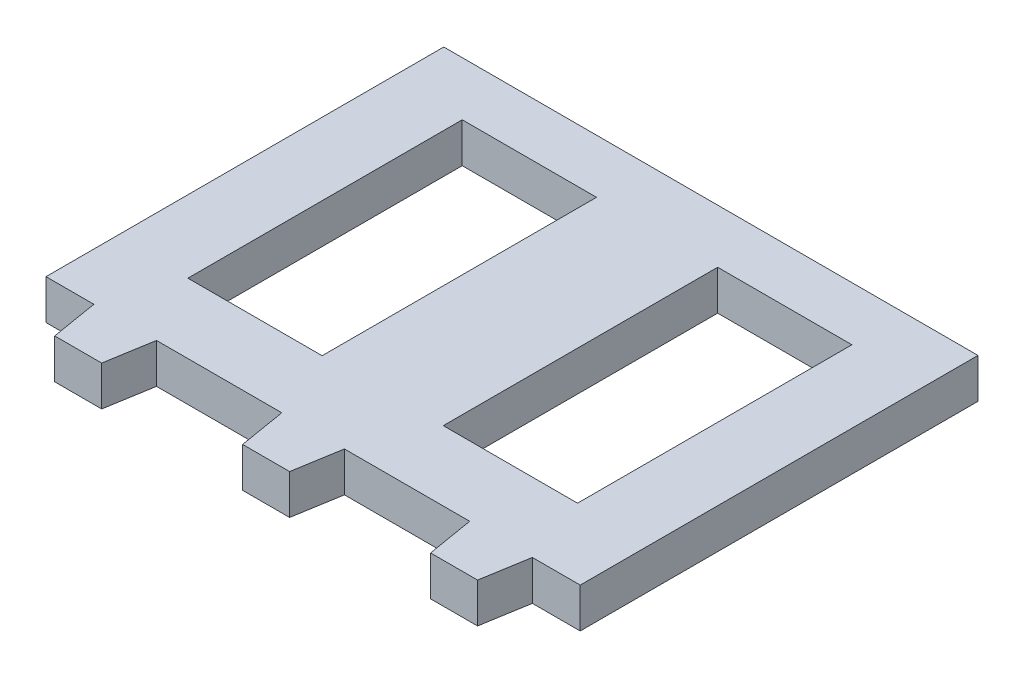
ISO-10303-21;
HEADER;
FILE_DESCRIPTION(('STEP AP214'),'2;1');
FILE_NAME('part.step','',(''),(''),'','','');
FILE_SCHEMA(('AUTOMOTIVE_DESIGN { 1 0 10303 214 1 1 1 1 }'));
ENDSEC;
DATA;
#1=APPLICATION_CONTEXT('core data for automotive mechanical design processes');
#2=APPLICATION_PROTOCOL_DEFINITION('international standard','automotive_design',2000,#1);
#3=PRODUCT_CONTEXT('',#1,'mechanical');
#4=PRODUCT('Part','Part','',(#3));
#5=PRODUCT_RELATED_PRODUCT_CATEGORY('part','',(#4));
#6=PRODUCT_DEFINITION_FORMATION('','',#4);
#7=PRODUCT_DEFINITION_CONTEXT('part definition',#1,'design');
#8=PRODUCT_DEFINITION('design','',#6,#7);
#9=PRODUCT_DEFINITION_SHAPE('','',#8);
#10=(LENGTH_UNIT() NAMED_UNIT(*) SI_UNIT(.MILLI.,.METRE.));
#11=(NAMED_UNIT(*) PLANE_ANGLE_UNIT() SI_UNIT($,.RADIAN.));
#12=(NAMED_UNIT(*) SI_UNIT($,.STERADIAN.) SOLID_ANGLE_UNIT());
#13=UNCERTAINTY_MEASURE_WITH_UNIT(LENGTH_MEASURE(1.E-05),#10,'distance_accuracy_value','');
#14=(GEOMETRIC_REPRESENTATION_CONTEXT(3) GLOBAL_UNCERTAINTY_ASSIGNED_CONTEXT((#13)) GLOBAL_UNIT_ASSIGNED_CONTEXT((#10,
#11,#12)) REPRESENTATION_CONTEXT('',''));
#15=CARTESIAN_POINT('',(0.,0.,0.));
#16=DIRECTION('',(0.,0.,1.));
#17=DIRECTION('',(1.,0.,0.));
#18=AXIS2_PLACEMENT_3D('',#15,#16,#17);
#19=CARTESIAN_POINT('',(0.,6.35,-23.158929520171));
#20=DIRECTION('',(0.,0.,1.));
#21=DIRECTION('',(1.,0.,0.));
#22=AXIS2_PLACEMENT_3D('',#19,#20,#21);
#23=PLANE('',#22);
#24=DIRECTION('',(-1.,0.,0.));
#25=VECTOR('',#24,1.);
#26=CARTESIAN_POINT('',(0.,0.,-23.158929520171));
#27=LINE('',#26,#25);
#28=CARTESIAN_POINT('',(31.1021106645058,0.,-23.158929520171));
#29=VERTEX_POINT('',#28);
#30=CARTESIAN_POINT('',(9.66965923601748,0.,-23.158929520171));
#31=VERTEX_POINT('',#30);
#32=EDGE_CURVE('E335',#29,#31,#27,.T.);
#33=ORIENTED_EDGE('',*,*,#32,.F.);
#34=DIRECTION('',(0.,-1.,0.));
#35=VECTOR('',#34,1.);
#36=CARTESIAN_POINT('',(31.1021106645058,6.35,-23.158929520171));
#37=LINE('',#36,#35);
#38=CARTESIAN_POINT('',(31.1021106645058,6.35,-23.158929520171));
#39=VERTEX_POINT('',#38);
#40=EDGE_CURVE('E11',#39,#29,#37,.T.);
#41=ORIENTED_EDGE('',*,*,#40,.F.);
#42=DIRECTION('',(-1.,0.,0.));
#43=VECTOR('',#42,1.);
#44=CARTESIAN_POINT('',(0.,6.35,-23.158929520171));
#45=LINE('',#44,#43);
#46=CARTESIAN_POINT('',(9.66965923601748,6.35,-23.158929520171));
#47=VERTEX_POINT('',#46);
#48=EDGE_CURVE('E215',#39,#47,#45,.T.);
#49=ORIENTED_EDGE('',*,*,#48,.T.);
#50=DIRECTION('',(0.,-1.,0.));
#51=VECTOR('',#50,1.);
#52=CARTESIAN_POINT('',(9.66965923601748,6.35,-23.158929520171));
#53=LINE('',#52,#51);
#54=EDGE_CURVE('E53',#47,#31,#53,.T.);
#55=ORIENTED_EDGE('',*,*,#54,.T.);
#56=EDGE_LOOP('',(#33,#41,#49,#55));
#57=FACE_BOUND('',#56,.T.);
#58=ADVANCED_FACE('F34',(#57),#23,.T.);
#59=CARTESIAN_POINT('',(31.1021106645058,6.35,0.));
#60=DIRECTION('',(1.,0.,0.));
#61=DIRECTION('',(0.,0.,-1.));
#62=AXIS2_PLACEMENT_3D('',#59,#60,#61);
#63=PLANE('',#62);
#64=DIRECTION('',(0.,0.,1.));
#65=VECTOR('',#64,1.);
#66=CARTESIAN_POINT('',(31.1021106645058,0.,0.));
#67=LINE('',#66,#65);
#68=CARTESIAN_POINT('',(31.1021106645058,0.,20.6396006199157));
#69=VERTEX_POINT('',#68);
#70=EDGE_CURVE('E220',#29,#69,#67,.T.);
#71=ORIENTED_EDGE('',*,*,#70,.T.);
#72=DIRECTION('',(0.,-1.,0.));
#73=VECTOR('',#72,1.);
#74=CARTESIAN_POINT('',(31.1021106645058,6.35,20.6396006199157));
#75=LINE('',#74,#73);
#76=CARTESIAN_POINT('',(31.1021106645058,6.35,20.6396006199157));
#77=VERTEX_POINT('',#76);
#78=EDGE_CURVE('E44',#77,#69,#75,.T.);
#79=ORIENTED_EDGE('',*,*,#78,.F.);
#80=DIRECTION('',(0.,0.,1.));
#81=VECTOR('',#80,1.);
#82=CARTESIAN_POINT('',(31.1021106645058,6.35,0.));
#83=LINE('',#82,#81);
#84=EDGE_CURVE('E210',#39,#77,#83,.T.);
#85=ORIENTED_EDGE('',*,*,#84,.F.);
#86=ORIENTED_EDGE('',*,*,#40,.T.);
#87=EDGE_LOOP('',(#71,#79,#85,#86));
#88=FACE_BOUND('',#87,.T.);
#89=ADVANCED_FACE('F218',(#88),#63,.F.);
#90=CARTESIAN_POINT('',(0.,6.35,20.6396006199157));
#91=DIRECTION('',(0.,0.,1.));
#92=DIRECTION('',(1.,0.,0.));
#93=AXIS2_PLACEMENT_3D('',#90,#91,#92);
#94=PLANE('',#93);
#95=DIRECTION('',(-1.,0.,0.));
#96=VECTOR('',#95,1.);
#97=CARTESIAN_POINT('',(0.,0.,20.6396006199157));
#98=LINE('',#97,#96);
#99=CARTESIAN_POINT('',(9.66965923601748,0.,20.6396006199157));
#100=VERTEX_POINT('',#99);
#101=EDGE_CURVE('E338',#69,#100,#98,.T.);
#102=ORIENTED_EDGE('',*,*,#101,.T.);
#103=DIRECTION('',(0.,-1.,0.));
#104=VECTOR('',#103,1.);
#105=CARTESIAN_POINT('',(9.66965923601748,6.35,20.6396006199157));
#106=LINE('',#105,#104);
#107=CARTESIAN_POINT('',(9.66965923601748,6.35,20.6396006199157));
#108=VERTEX_POINT('',#107);
#109=EDGE_CURVE('E127',#108,#100,#106,.T.);
#110=ORIENTED_EDGE('',*,*,#109,.F.);
#111=DIRECTION('',(-1.,0.,0.));
#112=VECTOR('',#111,1.);
#113=CARTESIAN_POINT('',(0.,6.35,20.6396006199157));
#114=LINE('',#113,#112);
#115=EDGE_CURVE('E202',#77,#108,#114,.T.);
#116=ORIENTED_EDGE('',*,*,#115,.F.);
#117=ORIENTED_EDGE('',*,*,#78,.T.);
#118=EDGE_LOOP('',(#102,#110,#116,#117));
#119=FACE_BOUND('',#118,.T.);
#120=ADVANCED_FACE('F204',(#119),#94,.F.);
#121=CARTESIAN_POINT('',(0.,6.35,-23.158929520171));
#122=DIRECTION('',(0.,0.,-1.));
#123=DIRECTION('',(-1.,0.,0.));
#124=AXIS2_PLACEMENT_3D('',#121,#122,#123);
#125=PLANE('',#124);
#126=DIRECTION('',(1.,0.,0.));
#127=VECTOR('',#126,1.);
#128=CARTESIAN_POINT('',(0.,0.,-23.158929520171));
#129=LINE('',#128,#127);
#130=CARTESIAN_POINT('',(-31.1021106645058,0.,-23.158929520171));
#131=VERTEX_POINT('',#130);
#132=CARTESIAN_POINT('',(-9.66965923601748,0.,-23.158929520171));
#133=VERTEX_POINT('',#132);
#134=EDGE_CURVE('E323',#131,#133,#129,.T.);
#135=ORIENTED_EDGE('',*,*,#134,.T.);
#136=DIRECTION('',(0.,-1.,0.));
#137=VECTOR('',#136,1.);
#138=CARTESIAN_POINT('',(-9.66965923601748,6.35,-23.158929520171));
#139=LINE('',#138,#137);
#140=CARTESIAN_POINT('',(-9.66965923601748,6.35,-23.158929520171));
#141=VERTEX_POINT('',#140);
#142=EDGE_CURVE('E231',#141,#133,#139,.T.);
#143=ORIENTED_EDGE('',*,*,#142,.F.);
#144=DIRECTION('',(1.,0.,0.));
#145=VECTOR('',#144,1.);
#146=CARTESIAN_POINT('',(0.,6.35,-23.158929520171));
#147=LINE('',#146,#145);
#148=CARTESIAN_POINT('',(-31.1021106645058,6.35,-23.158929520171));
#149=VERTEX_POINT('',#148);
#150=EDGE_CURVE('E378',#149,#141,#147,.T.);
#151=ORIENTED_EDGE('',*,*,#150,.F.);
#152=DIRECTION('',(0.,-1.,0.));
#153=VECTOR('',#152,1.);
#154=CARTESIAN_POINT('',(-31.1021106645058,6.35,-23.158929520171));
#155=LINE('',#154,#153);
#156=EDGE_CURVE('E225',#149,#131,#155,.T.);
#157=ORIENTED_EDGE('',*,*,#156,.T.);
#158=EDGE_LOOP('',(#135,#143,#151,#157));
#159=FACE_BOUND('',#158,.T.);
#160=ADVANCED_FACE('F424',(#159),#125,.F.);
#161=CARTESIAN_POINT('',(-9.66965923601748,6.35,0.));
#162=DIRECTION('',(1.,0.,0.));
#163=DIRECTION('',(0.,0.,-1.));
#164=AXIS2_PLACEMENT_3D('',#161,#162,#163);
#165=PLANE('',#164);
#166=DIRECTION('',(0.,0.,1.));
#167=VECTOR('',#166,1.);
#168=CARTESIAN_POINT('',(-9.66965923601748,0.,0.));
#169=LINE('',#168,#167);
#170=CARTESIAN_POINT('',(-9.66965923601748,0.,20.6396006199157));
#171=VERTEX_POINT('',#170);
#172=EDGE_CURVE('E326',#133,#171,#169,.T.);
#173=ORIENTED_EDGE('',*,*,#172,.T.);
#174=DIRECTION('',(0.,-1.,0.));
#175=VECTOR('',#174,1.);
#176=CARTESIAN_POINT('',(-9.66965923601748,6.35,20.6396006199157));
#177=LINE('',#176,#175);
#178=CARTESIAN_POINT('',(-9.66965923601748,6.35,20.6396006199157));
#179=VERTEX_POINT('',#178);
#180=EDGE_CURVE('E229',#179,#171,#177,.T.);
#181=ORIENTED_EDGE('',*,*,#180,.F.);
#182=DIRECTION('',(0.,0.,1.));
#183=VECTOR('',#182,1.);
#184=CARTESIAN_POINT('',(-9.66965923601748,6.35,0.));
#185=LINE('',#184,#183);
#186=EDGE_CURVE('E381',#141,#179,#185,.T.);
#187=ORIENTED_EDGE('',*,*,#186,.F.);
#188=ORIENTED_EDGE('',*,*,#142,.T.);
#189=EDGE_LOOP('',(#173,#181,#187,#188));
#190=FACE_BOUND('',#189,.T.);
#191=ADVANCED_FACE('F420',(#190),#165,.F.);
#192=CARTESIAN_POINT('',(0.,6.35,20.6396006199157));
#193=DIRECTION('',(0.,0.,-1.));
#194=DIRECTION('',(-1.,0.,0.));
#195=AXIS2_PLACEMENT_3D('',#192,#193,#194);
#196=PLANE('',#195);
#197=DIRECTION('',(1.,0.,0.));
#198=VECTOR('',#197,1.);
#199=CARTESIAN_POINT('',(0.,0.,20.6396006199157));
#200=LINE('',#199,#198);
#201=CARTESIAN_POINT('',(-31.1021106645058,0.,20.6396006199157));
#202=VERTEX_POINT('',#201);
#203=EDGE_CURVE('E329',#202,#171,#200,.T.);
#204=ORIENTED_EDGE('',*,*,#203,.F.);
#205=DIRECTION('',(0.,-1.,0.));
#206=VECTOR('',#205,1.);
#207=CARTESIAN_POINT('',(-31.1021106645058,6.35,20.6396006199157));
#208=LINE('',#207,#206);
#209=CARTESIAN_POINT('',(-31.1021106645058,6.35,20.6396006199157));
#210=VERTEX_POINT('',#209);
#211=EDGE_CURVE('E227',#210,#202,#208,.T.);
#212=ORIENTED_EDGE('',*,*,#211,.F.);
#213=DIRECTION('',(1.,0.,0.));
#214=VECTOR('',#213,1.);
#215=CARTESIAN_POINT('',(0.,6.35,20.6396006199157));
#216=LINE('',#215,#214);
#217=EDGE_CURVE('E383',#210,#179,#216,.T.);
#218=ORIENTED_EDGE('',*,*,#217,.T.);
#219=ORIENTED_EDGE('',*,*,#180,.T.);
#220=EDGE_LOOP('',(#204,#212,#218,#219));
#221=FACE_BOUND('',#220,.T.);
#222=ADVANCED_FACE('F417',(#221),#196,.T.);
#223=CARTESIAN_POINT('',(42.6397952780144,6.35,0.));
#224=DIRECTION('',(1.,0.,0.));
#225=DIRECTION('',(0.,0.,-1.));
#226=AXIS2_PLACEMENT_3D('',#223,#224,#225);
#227=PLANE('',#226);
#228=DIRECTION('',(0.,0.,1.));
#229=VECTOR('',#228,1.);
#230=CARTESIAN_POINT('',(42.6397952780144,0.,0.));
#231=LINE('',#230,#229);
#232=CARTESIAN_POINT('',(42.6397952780144,0.,-31.75));
#233=VERTEX_POINT('',#232);
#234=CARTESIAN_POINT('',(42.6397952780144,0.,31.75));
#235=VERTEX_POINT('',#234);
#236=EDGE_CURVE('E279',#233,#235,#231,.T.);
#237=ORIENTED_EDGE('',*,*,#236,.F.);
#238=DIRECTION('',(0.,-1.,0.));
#239=VECTOR('',#238,1.);
#240=CARTESIAN_POINT('',(42.6397952780144,6.35,-31.75));
#241=LINE('',#240,#239);
#242=CARTESIAN_POINT('',(42.6397952780144,6.35,-31.75));
#243=VERTEX_POINT('',#242);
#244=EDGE_CURVE('E38',#243,#233,#241,.T.);
#245=ORIENTED_EDGE('',*,*,#244,.F.);
#246=DIRECTION('',(0.,0.,1.));
#247=VECTOR('',#246,1.);
#248=CARTESIAN_POINT('',(42.6397952780144,6.35,0.));
#249=LINE('',#248,#247);
#250=CARTESIAN_POINT('',(42.6397952780144,6.35,31.75));
#251=VERTEX_POINT('',#250);
#252=EDGE_CURVE('E342',#243,#251,#249,.T.);
#253=ORIENTED_EDGE('',*,*,#252,.T.);
#254=DIRECTION('',(0.,-1.,0.));
#255=VECTOR('',#254,1.);
#256=CARTESIAN_POINT('',(42.6397952780144,6.35,31.75));
#257=LINE('',#256,#255);
#258=EDGE_CURVE('E234',#251,#235,#257,.T.);
#259=ORIENTED_EDGE('',*,*,#258,.T.);
#260=EDGE_LOOP('',(#237,#245,#253,#259));
#261=FACE_BOUND('',#260,.T.);
#262=ADVANCED_FACE('F36',(#261),#227,.T.);
#263=CARTESIAN_POINT('',(0.,6.35,-31.75));
#264=DIRECTION('',(0.,0.,-1.));
#265=DIRECTION('',(-1.,0.,0.));
#266=AXIS2_PLACEMENT_3D('',#263,#264,#265);
#267=PLANE('',#266);
#268=DIRECTION('',(1.,0.,0.));
#269=VECTOR('',#268,1.);
#270=CARTESIAN_POINT('',(0.,0.,-31.75));
#271=LINE('',#270,#269);
#272=CARTESIAN_POINT('',(-42.6397952780144,0.,-31.75));
#273=VERTEX_POINT('',#272);
#274=EDGE_CURVE('E275',#273,#233,#271,.T.);
#275=ORIENTED_EDGE('',*,*,#274,.F.);
#276=DIRECTION('',(0.,-1.,0.));
#277=VECTOR('',#276,1.);
#278=CARTESIAN_POINT('',(-42.6397952780144,6.35,-31.75));
#279=LINE('',#278,#277);
#280=CARTESIAN_POINT('',(-42.6397952780144,6.35,-31.75));
#281=VERTEX_POINT('',#280);
#282=EDGE_CURVE('E266',#281,#273,#279,.T.);
#283=ORIENTED_EDGE('',*,*,#282,.F.);
#284=DIRECTION('',(1.,0.,0.));
#285=VECTOR('',#284,1.);
#286=CARTESIAN_POINT('',(0.,6.35,-31.75));
#287=LINE('',#286,#285);
#288=EDGE_CURVE('E277',#281,#243,#287,.T.);
#289=ORIENTED_EDGE('',*,*,#288,.T.);
#290=ORIENTED_EDGE('',*,*,#244,.T.);
#291=EDGE_LOOP('',(#275,#283,#289,#290));
#292=FACE_BOUND('',#291,.T.);
#293=ADVANCED_FACE('F273',(#292),#267,.T.);
#294=CARTESIAN_POINT('',(-42.6397952780144,6.35,0.));
#295=DIRECTION('',(1.,0.,0.));
#296=DIRECTION('',(0.,0.,-1.));
#297=AXIS2_PLACEMENT_3D('',#294,#295,#296);
#298=PLANE('',#297);
#299=DIRECTION('',(0.,0.,1.));
#300=VECTOR('',#299,1.);
#301=CARTESIAN_POINT('',(-42.6397952780144,0.,0.));
#302=LINE('',#301,#300);
#303=CARTESIAN_POINT('',(-42.6397952780144,0.,31.75));
#304=VERTEX_POINT('',#303);
#305=EDGE_CURVE('E288',#273,#304,#302,.T.);
#306=ORIENTED_EDGE('',*,*,#305,.T.);
#307=DIRECTION('',(0.,-1.,0.));
#308=VECTOR('',#307,1.);
#309=CARTESIAN_POINT('',(-42.6397952780144,6.35,31.75));
#310=LINE('',#309,#308);
#311=CARTESIAN_POINT('',(-42.6397952780144,6.35,31.75));
#312=VERTEX_POINT('',#311);
#313=EDGE_CURVE('E264',#312,#304,#310,.T.);
#314=ORIENTED_EDGE('',*,*,#313,.F.);
#315=DIRECTION('',(0.,0.,1.));
#316=VECTOR('',#315,1.);
#317=CARTESIAN_POINT('',(-42.6397952780144,6.35,0.));
#318=LINE('',#317,#316);
#319=EDGE_CURVE('E345',#281,#312,#318,.T.);
#320=ORIENTED_EDGE('',*,*,#319,.F.);
#321=ORIENTED_EDGE('',*,*,#282,.T.);
#322=EDGE_LOOP('',(#306,#314,#320,#321));
#323=FACE_BOUND('',#322,.T.);
#324=ADVANCED_FACE('F465',(#323),#298,.F.);
#325=CARTESIAN_POINT('',(0.,6.35,31.75));
#326=DIRECTION('',(0.,0.,-1.));
#327=DIRECTION('',(-1.,0.,0.));
#328=AXIS2_PLACEMENT_3D('',#325,#326,#327);
#329=PLANE('',#328);
#330=DIRECTION('',(1.,0.,0.));
#331=VECTOR('',#330,1.);
#332=CARTESIAN_POINT('',(0.,0.,31.75));
#333=LINE('',#332,#331);
#334=CARTESIAN_POINT('',(-35.,0.,31.75));
#335=VERTEX_POINT('',#334);
#336=EDGE_CURVE('E290',#304,#335,#333,.T.);
#337=ORIENTED_EDGE('',*,*,#336,.T.);
#338=DIRECTION('',(0.,-1.,0.));
#339=VECTOR('',#338,1.);
#340=CARTESIAN_POINT('',(-35.,6.35,31.75));
#341=LINE('',#340,#339);
#342=CARTESIAN_POINT('',(-35.,6.35,31.75));
#343=VERTEX_POINT('',#342);
#344=EDGE_CURVE('E262',#343,#335,#341,.T.);
#345=ORIENTED_EDGE('',*,*,#344,.F.);
#346=DIRECTION('',(1.,0.,0.));
#347=VECTOR('',#346,1.);
#348=CARTESIAN_POINT('',(0.,6.35,31.75));
#349=LINE('',#348,#347);
#350=EDGE_CURVE('E349',#312,#343,#349,.T.);
#351=ORIENTED_EDGE('',*,*,#350,.F.);
#352=ORIENTED_EDGE('',*,*,#313,.T.);
#353=EDGE_LOOP('',(#337,#345,#351,#352));
#354=FACE_BOUND('',#353,.T.);
#355=ADVANCED_FACE('F402',(#354),#329,.F.);
#356=CARTESIAN_POINT('',(-39.2027027027027,6.35,6.53378378378386));
#357=DIRECTION('',(-0.986393923832143,0.,0.164398987305359));
#358=DIRECTION('',(0.164398987305359,0.,0.986393923832144));
#359=AXIS2_PLACEMENT_3D('',#356,#357,#358);
#360=PLANE('',#359);
#361=DIRECTION('',(-0.164398987305359,0.,-0.986393923832143));
#362=VECTOR('',#361,1.);
#363=CARTESIAN_POINT('',(-39.2027027027027,0.,6.53378378378386));
#364=LINE('',#363,#362);
#365=CARTESIAN_POINT('',(-33.75,0.,39.25));
#366=VERTEX_POINT('',#365);
#367=EDGE_CURVE('E296',#366,#335,#364,.T.);
#368=ORIENTED_EDGE('',*,*,#367,.F.);
#369=DIRECTION('',(0.,-1.,0.));
#370=VECTOR('',#369,1.);
#371=CARTESIAN_POINT('',(-33.75,6.35,39.25));
#372=LINE('',#371,#370);
#373=CARTESIAN_POINT('',(-33.75,6.35,39.25));
#374=VERTEX_POINT('',#373);
#375=EDGE_CURVE('E260',#374,#366,#372,.T.);
#376=ORIENTED_EDGE('',*,*,#375,.F.);
#377=DIRECTION('',(-0.164398987305359,0.,-0.986393923832143));
#378=VECTOR('',#377,1.);
#379=CARTESIAN_POINT('',(-39.2027027027027,6.35,6.53378378378386));
#380=LINE('',#379,#378);
#381=EDGE_CURVE('E351',#374,#343,#380,.T.);
#382=ORIENTED_EDGE('',*,*,#381,.T.);
#383=ORIENTED_EDGE('',*,*,#344,.T.);
#384=EDGE_LOOP('',(#368,#376,#382,#383));
#385=FACE_BOUND('',#384,.T.);
#386=ADVANCED_FACE('F460',(#385),#360,.T.);
#387=CARTESIAN_POINT('',(0.,6.35,39.25));
#388=DIRECTION('',(0.,0.,1.));
#389=DIRECTION('',(1.,0.,0.));
#390=AXIS2_PLACEMENT_3D('',#387,#388,#389);
#391=PLANE('',#390);
#392=DIRECTION('',(-1.,0.,0.));
#393=VECTOR('',#392,1.);
#394=CARTESIAN_POINT('',(0.,0.,39.25));
#395=LINE('',#394,#393);
#396=CARTESIAN_POINT('',(-26.25,0.,39.25));
#397=VERTEX_POINT('',#396);
#398=EDGE_CURVE('E301',#397,#366,#395,.T.);
#399=ORIENTED_EDGE('',*,*,#398,.F.);
#400=DIRECTION('',(0.,-1.,0.));
#401=VECTOR('',#400,1.);
#402=CARTESIAN_POINT('',(-26.25,6.35,39.25));
#403=LINE('',#402,#401);
#404=CARTESIAN_POINT('',(-26.25,6.35,39.25));
#405=VERTEX_POINT('',#404);
#406=EDGE_CURVE('E258',#405,#397,#403,.T.);
#407=ORIENTED_EDGE('',*,*,#406,.F.);
#408=DIRECTION('',(-1.,0.,0.));
#409=VECTOR('',#408,1.);
#410=CARTESIAN_POINT('',(0.,6.35,39.25));
#411=LINE('',#410,#409);
#412=EDGE_CURVE('E356',#405,#374,#411,.T.);
#413=ORIENTED_EDGE('',*,*,#412,.T.);
#414=ORIENTED_EDGE('',*,*,#375,.T.);
#415=EDGE_LOOP('',(#399,#407,#413,#414));
#416=FACE_BOUND('',#415,.T.);
#417=ADVANCED_FACE('F456',(#416),#391,.T.);
#418=CARTESIAN_POINT('',(-19.1756756756758,6.35,-3.19594594594592));
#419=DIRECTION('',(0.986393923832144,0.,0.164398987305355));
#420=DIRECTION('',(0.164398987305355,0.,-0.986393923832144));
#421=AXIS2_PLACEMENT_3D('',#418,#419,#420);
#422=PLANE('',#421);
#423=DIRECTION('',(-0.164398987305355,0.,0.986393923832144));
#424=VECTOR('',#423,1.);
#425=CARTESIAN_POINT('',(-19.1756756756758,0.,-3.19594594594592));
#426=LINE('',#425,#424);
#427=CARTESIAN_POINT('',(-25.,0.,31.75));
#428=VERTEX_POINT('',#427);
#429=EDGE_CURVE('E304',#428,#397,#426,.T.);
#430=ORIENTED_EDGE('',*,*,#429,.F.);
#431=DIRECTION('',(0.,-1.,0.));
#432=VECTOR('',#431,1.);
#433=CARTESIAN_POINT('',(-25.,6.35,31.75));
#434=LINE('',#433,#432);
#435=CARTESIAN_POINT('',(-25.,6.35,31.75));
#436=VERTEX_POINT('',#435);
#437=EDGE_CURVE('E256',#436,#428,#434,.T.);
#438=ORIENTED_EDGE('',*,*,#437,.F.);
#439=DIRECTION('',(-0.164398987305355,0.,0.986393923832144));
#440=VECTOR('',#439,1.);
#441=CARTESIAN_POINT('',(-19.1756756756758,6.35,-3.19594594594592));
#442=LINE('',#441,#440);
#443=EDGE_CURVE('E359',#436,#405,#442,.T.);
#444=ORIENTED_EDGE('',*,*,#443,.T.);
#445=ORIENTED_EDGE('',*,*,#406,.T.);
#446=EDGE_LOOP('',(#430,#438,#444,#445));
#447=FACE_BOUND('',#446,.T.);
#448=ADVANCED_FACE('F453',(#447),#422,.T.);
#449=CARTESIAN_POINT('',(-5.,0.,31.75));
#450=VERTEX_POINT('',#449);
#451=EDGE_CURVE('E298',#428,#450,#333,.T.);
#452=ORIENTED_EDGE('',*,*,#451,.T.);
#453=DIRECTION('',(0.,-1.,0.));
#454=VECTOR('',#453,1.);
#455=CARTESIAN_POINT('',(-5.,6.35,31.75));
#456=LINE('',#455,#454);
#457=CARTESIAN_POINT('',(-5.,6.35,31.75));
#458=VERTEX_POINT('',#457);
#459=EDGE_CURVE('E254',#458,#450,#456,.T.);
#460=ORIENTED_EDGE('',*,*,#459,.F.);
#461=EDGE_CURVE('E353',#436,#458,#349,.T.);
#462=ORIENTED_EDGE('',*,*,#461,.F.);
#463=ORIENTED_EDGE('',*,*,#437,.T.);
#464=EDGE_LOOP('',(#452,#460,#462,#463));
#465=FACE_BOUND('',#464,.T.);
#466=ADVANCED_FACE('F451',(#465),#329,.F.);
#467=CARTESIAN_POINT('',(-10.0135135135135,6.35,1.66891891891893));
#468=DIRECTION('',(-0.986393923832144,0.,0.164398987305358));
#469=DIRECTION('',(0.164398987305358,0.,0.986393923832144));
#470=AXIS2_PLACEMENT_3D('',#467,#468,#469);
#471=PLANE('',#470);
#472=DIRECTION('',(-0.164398987305358,0.,-0.986393923832144));
#473=VECTOR('',#472,1.);
#474=CARTESIAN_POINT('',(-10.0135135135135,0.,1.66891891891893));
#475=LINE('',#474,#473);
#476=CARTESIAN_POINT('',(-3.75,0.,39.25));
#477=VERTEX_POINT('',#476);
#478=EDGE_CURVE('E307',#477,#450,#475,.T.);
#479=ORIENTED_EDGE('',*,*,#478,.F.);
#480=DIRECTION('',(0.,-1.,0.));
#481=VECTOR('',#480,1.);
#482=CARTESIAN_POINT('',(-3.75,6.35,39.25));
#483=LINE('',#482,#481);
#484=CARTESIAN_POINT('',(-3.75,6.35,39.25));
#485=VERTEX_POINT('',#484);
#486=EDGE_CURVE('E252',#485,#477,#483,.T.);
#487=ORIENTED_EDGE('',*,*,#486,.F.);
#488=DIRECTION('',(-0.164398987305358,0.,-0.986393923832144));
#489=VECTOR('',#488,1.);
#490=CARTESIAN_POINT('',(-10.0135135135135,6.35,1.66891891891893));
#491=LINE('',#490,#489);
#492=EDGE_CURVE('E362',#485,#458,#491,.T.);
#493=ORIENTED_EDGE('',*,*,#492,.T.);
#494=ORIENTED_EDGE('',*,*,#459,.T.);
#495=EDGE_LOOP('',(#479,#487,#493,#494));
#496=FACE_BOUND('',#495,.T.);
#497=ADVANCED_FACE('F447',(#496),#471,.T.);
#498=CARTESIAN_POINT('',(0.,6.35,39.25));
#499=DIRECTION('',(0.,0.,1.));
#500=DIRECTION('',(1.,0.,0.));
#501=AXIS2_PLACEMENT_3D('',#498,#499,#500);
#502=PLANE('',#501);
#503=DIRECTION('',(-1.,0.,0.));
#504=VECTOR('',#503,1.);
#505=CARTESIAN_POINT('',(0.,0.,39.25));
#506=LINE('',#505,#504);
#507=CARTESIAN_POINT('',(3.75,0.,39.25));
#508=VERTEX_POINT('',#507);
#509=EDGE_CURVE('E310',#508,#477,#506,.T.);
#510=ORIENTED_EDGE('',*,*,#509,.F.);
#511=DIRECTION('',(0.,-1.,0.));
#512=VECTOR('',#511,1.);
#513=CARTESIAN_POINT('',(3.75,6.35,39.25));
#514=LINE('',#513,#512);
#515=CARTESIAN_POINT('',(3.75,6.35,39.25));
#516=VERTEX_POINT('',#515);
#517=EDGE_CURVE('E250',#516,#508,#514,.T.);
#518=ORIENTED_EDGE('',*,*,#517,.F.);
#519=DIRECTION('',(-1.,0.,0.));
#520=VECTOR('',#519,1.);
#521=CARTESIAN_POINT('',(0.,6.35,39.25));
#522=LINE('',#521,#520);
#523=EDGE_CURVE('E365',#516,#485,#522,.T.);
#524=ORIENTED_EDGE('',*,*,#523,.T.);
#525=ORIENTED_EDGE('',*,*,#486,.T.);
#526=EDGE_LOOP('',(#510,#518,#524,#525));
#527=FACE_BOUND('',#526,.T.);
#528=ADVANCED_FACE('F443',(#527),#502,.T.);
#529=CARTESIAN_POINT('',(10.0135135135135,6.35,1.66891891891892));
#530=DIRECTION('',(0.986393923832144,0.,0.164398987305357));
#531=DIRECTION('',(0.164398987305357,0.,-0.986393923832144));
#532=AXIS2_PLACEMENT_3D('',#529,#530,#531);
#533=PLANE('',#532);
#534=DIRECTION('',(-0.164398987305357,0.,0.986393923832144));
#535=VECTOR('',#534,1.);
#536=CARTESIAN_POINT('',(10.0135135135135,0.,1.66891891891892));
#537=LINE('',#536,#535);
#538=CARTESIAN_POINT('',(5.,0.,31.75));
#539=VERTEX_POINT('',#538);
#540=EDGE_CURVE('E313',#539,#508,#537,.T.);
#541=ORIENTED_EDGE('',*,*,#540,.F.);
#542=DIRECTION('',(0.,-1.,0.));
#543=VECTOR('',#542,1.);
#544=CARTESIAN_POINT('',(5.,6.35,31.75));
#545=LINE('',#544,#543);
#546=CARTESIAN_POINT('',(5.,6.35,31.75));
#547=VERTEX_POINT('',#546);
#548=EDGE_CURVE('E248',#547,#539,#545,.T.);
#549=ORIENTED_EDGE('',*,*,#548,.F.);
#550=DIRECTION('',(-0.164398987305357,0.,0.986393923832144));
#551=VECTOR('',#550,1.);
#552=CARTESIAN_POINT('',(10.0135135135135,6.35,1.66891891891892));
#553=LINE('',#552,#551);
#554=EDGE_CURVE('E368',#547,#516,#553,.T.);
#555=ORIENTED_EDGE('',*,*,#554,.T.);
#556=ORIENTED_EDGE('',*,*,#517,.T.);
#557=EDGE_LOOP('',(#541,#549,#555,#556));
#558=FACE_BOUND('',#557,.T.);
#559=ADVANCED_FACE('F440',(#558),#533,.T.);
#560=CARTESIAN_POINT('',(25.,0.,31.75));
#561=VERTEX_POINT('',#560);
#562=EDGE_CURVE('E316',#539,#561,#333,.T.);
#563=ORIENTED_EDGE('',*,*,#562,.T.);
#564=DIRECTION('',(0.,-1.,0.));
#565=VECTOR('',#564,1.);
#566=CARTESIAN_POINT('',(25.,6.35,31.75));
#567=LINE('',#566,#565);
#568=CARTESIAN_POINT('',(25.,6.35,31.75));
#569=VERTEX_POINT('',#568);
#570=EDGE_CURVE('E245',#569,#561,#567,.T.);
#571=ORIENTED_EDGE('',*,*,#570,.F.);
#572=EDGE_CURVE('E371',#547,#569,#349,.T.);
#573=ORIENTED_EDGE('',*,*,#572,.F.);
#574=ORIENTED_EDGE('',*,*,#548,.T.);
#575=EDGE_LOOP('',(#563,#571,#573,#574));
#576=FACE_BOUND('',#575,.T.);
#577=ADVANCED_FACE('F403',(#576),#329,.F.);
#578=CARTESIAN_POINT('',(19.1756756756757,6.35,-3.19594594594593));
#579=DIRECTION('',(0.986393923832144,0.,-0.164398987305356));
#580=DIRECTION('',(-0.164398987305356,0.,-0.986393923832144));
#581=AXIS2_PLACEMENT_3D('',#578,#579,#580);
#582=PLANE('',#581);
#583=DIRECTION('',(0.164398987305356,0.,0.986393923832144));
#584=VECTOR('',#583,1.);
#585=CARTESIAN_POINT('',(19.1756756756757,0.,-3.19594594594593));
#586=LINE('',#585,#584);
#587=CARTESIAN_POINT('',(26.25,0.,39.25));
#588=VERTEX_POINT('',#587);
#589=EDGE_CURVE('E317',#561,#588,#586,.T.);
#590=ORIENTED_EDGE('',*,*,#589,.T.);
#591=DIRECTION('',(0.,-1.,0.));
#592=VECTOR('',#591,1.);
#593=CARTESIAN_POINT('',(26.25,6.35,39.25));
#594=LINE('',#593,#592);
#595=CARTESIAN_POINT('',(26.25,6.35,39.25));
#596=VERTEX_POINT('',#595);
#597=EDGE_CURVE('E242',#596,#588,#594,.T.);
#598=ORIENTED_EDGE('',*,*,#597,.F.);
#599=DIRECTION('',(0.164398987305356,0.,0.986393923832144));
#600=VECTOR('',#599,1.);
#601=CARTESIAN_POINT('',(19.1756756756757,6.35,-3.19594594594593));
#602=LINE('',#601,#600);
#603=EDGE_CURVE('E372',#569,#596,#602,.T.);
#604=ORIENTED_EDGE('',*,*,#603,.F.);
#605=ORIENTED_EDGE('',*,*,#570,.T.);
#606=EDGE_LOOP('',(#590,#598,#604,#605));
#607=FACE_BOUND('',#606,.T.);
#608=ADVANCED_FACE('F435',(#607),#582,.F.);
#609=CARTESIAN_POINT('',(0.,6.35,39.25));
#610=DIRECTION('',(0.,0.,-1.));
#611=DIRECTION('',(-1.,0.,0.));
#612=AXIS2_PLACEMENT_3D('',#609,#610,#611);
#613=PLANE('',#612);
#614=DIRECTION('',(1.,0.,0.));
#615=VECTOR('',#614,1.);
#616=CARTESIAN_POINT('',(0.,0.,39.25));
#617=LINE('',#616,#615);
#618=CARTESIAN_POINT('',(33.75,0.,39.25));
#619=VERTEX_POINT('',#618);
#620=EDGE_CURVE('E319',#588,#619,#617,.T.);
#621=ORIENTED_EDGE('',*,*,#620,.T.);
#622=DIRECTION('',(0.,-1.,0.));
#623=VECTOR('',#622,1.);
#624=CARTESIAN_POINT('',(33.75,6.35,39.25));
#625=LINE('',#624,#623);
#626=CARTESIAN_POINT('',(33.75,6.35,39.25));
#627=VERTEX_POINT('',#626);
#628=EDGE_CURVE('E239',#627,#619,#625,.T.);
#629=ORIENTED_EDGE('',*,*,#628,.F.);
#630=DIRECTION('',(1.,0.,0.));
#631=VECTOR('',#630,1.);
#632=CARTESIAN_POINT('',(0.,6.35,39.25));
#633=LINE('',#632,#631);
#634=EDGE_CURVE('E374',#596,#627,#633,.T.);
#635=ORIENTED_EDGE('',*,*,#634,.F.);
#636=ORIENTED_EDGE('',*,*,#597,.T.);
#637=EDGE_LOOP('',(#621,#629,#635,#636));
#638=FACE_BOUND('',#637,.T.);
#639=ADVANCED_FACE('F431',(#638),#613,.F.);
#640=CARTESIAN_POINT('',(39.2027027027027,6.35,6.53378378378379));
#641=DIRECTION('',(-0.986393923832144,0.,-0.164398987305357));
#642=DIRECTION('',(-0.164398987305357,0.,0.986393923832144));
#643=AXIS2_PLACEMENT_3D('',#640,#641,#642);
#644=PLANE('',#643);
#645=DIRECTION('',(0.164398987305357,0.,-0.986393923832144));
#646=VECTOR('',#645,1.);
#647=CARTESIAN_POINT('',(39.2027027027027,0.,6.53378378378379));
#648=LINE('',#647,#646);
#649=CARTESIAN_POINT('',(35.,0.,31.75));
#650=VERTEX_POINT('',#649);
#651=EDGE_CURVE('E321',#619,#650,#648,.T.);
#652=ORIENTED_EDGE('',*,*,#651,.T.);
#653=DIRECTION('',(0.,-1.,0.));
#654=VECTOR('',#653,1.);
#655=CARTESIAN_POINT('',(35.,6.35,31.75));
#656=LINE('',#655,#654);
#657=CARTESIAN_POINT('',(35.,6.35,31.75));
#658=VERTEX_POINT('',#657);
#659=EDGE_CURVE('E236',#658,#650,#656,.T.);
#660=ORIENTED_EDGE('',*,*,#659,.F.);
#661=DIRECTION('',(0.164398987305357,0.,-0.986393923832144));
#662=VECTOR('',#661,1.);
#663=CARTESIAN_POINT('',(39.2027027027027,6.35,6.53378378378379));
#664=LINE('',#663,#662);
#665=EDGE_CURVE('E376',#627,#658,#664,.T.);
#666=ORIENTED_EDGE('',*,*,#665,.F.);
#667=ORIENTED_EDGE('',*,*,#628,.T.);
#668=EDGE_LOOP('',(#652,#660,#666,#667));
#669=FACE_BOUND('',#668,.T.);
#670=ADVANCED_FACE('F415',(#669),#644,.F.);
#671=CARTESIAN_POINT('',(-31.1021106645058,6.35,0.));
#672=DIRECTION('',(1.,0.,0.));
#673=DIRECTION('',(0.,0.,-1.));
#674=AXIS2_PLACEMENT_3D('',#671,#672,#673);
#675=PLANE('',#674);
#676=DIRECTION('',(0.,0.,1.));
#677=VECTOR('',#676,1.);
#678=CARTESIAN_POINT('',(-31.1021106645058,0.,0.));
#679=LINE('',#678,#677);
#680=EDGE_CURVE('E332',#131,#202,#679,.T.);
#681=ORIENTED_EDGE('',*,*,#680,.F.);
#682=ORIENTED_EDGE('',*,*,#156,.F.);
#683=DIRECTION('',(0.,0.,1.));
#684=VECTOR('',#683,1.);
#685=CARTESIAN_POINT('',(-31.1021106645058,6.35,0.));
#686=LINE('',#685,#684);
#687=EDGE_CURVE('E386',#149,#210,#686,.T.);
#688=ORIENTED_EDGE('',*,*,#687,.T.);
#689=ORIENTED_EDGE('',*,*,#211,.T.);
#690=EDGE_LOOP('',(#681,#682,#688,#689));
#691=FACE_BOUND('',#690,.T.);
#692=ADVANCED_FACE('F399',(#691),#675,.T.);
#693=EDGE_CURVE('E297',#650,#235,#333,.T.);
#694=ORIENTED_EDGE('',*,*,#693,.T.);
#695=ORIENTED_EDGE('',*,*,#258,.F.);
#696=EDGE_CURVE('E352',#658,#251,#349,.T.);
#697=ORIENTED_EDGE('',*,*,#696,.F.);
#698=ORIENTED_EDGE('',*,*,#659,.T.);
#699=EDGE_LOOP('',(#694,#695,#697,#698));
#700=FACE_BOUND('',#699,.T.);
#701=ADVANCED_FACE('F391',(#700),#329,.F.);
#702=CARTESIAN_POINT('',(9.66965923601748,6.35,0.));
#703=DIRECTION('',(1.,0.,0.));
#704=DIRECTION('',(0.,0.,-1.));
#705=AXIS2_PLACEMENT_3D('',#702,#703,#704);
#706=PLANE('',#705);
#707=DIRECTION('',(0.,0.,1.));
#708=VECTOR('',#707,1.);
#709=CARTESIAN_POINT('',(9.66965923601748,0.,0.));
#710=LINE('',#709,#708);
#711=EDGE_CURVE('E340',#31,#100,#710,.T.);
#712=ORIENTED_EDGE('',*,*,#711,.F.);
#713=ORIENTED_EDGE('',*,*,#54,.F.);
#714=DIRECTION('',(0.,0.,1.));
#715=VECTOR('',#714,1.);
#716=CARTESIAN_POINT('',(9.66965923601748,6.35,0.));
#717=LINE('',#716,#715);
#718=EDGE_CURVE('E209',#47,#108,#717,.T.);
#719=ORIENTED_EDGE('',*,*,#718,.T.);
#720=ORIENTED_EDGE('',*,*,#109,.T.);
#721=EDGE_LOOP('',(#712,#713,#719,#720));
#722=FACE_BOUND('',#721,.T.);
#723=ADVANCED_FACE('F389',(#722),#706,.T.);
#724=CARTESIAN_POINT('',(0.,6.35,0.));
#725=DIRECTION('',(0.,1.,0.));
#726=DIRECTION('',(0.,0.,1.));
#727=AXIS2_PLACEMENT_3D('',#724,#725,#726);
#728=PLANE('',#727);
#729=ORIENTED_EDGE('',*,*,#252,.F.);
#730=ORIENTED_EDGE('',*,*,#288,.F.);
#731=ORIENTED_EDGE('',*,*,#319,.T.);
#732=ORIENTED_EDGE('',*,*,#350,.T.);
#733=ORIENTED_EDGE('',*,*,#381,.F.);
#734=ORIENTED_EDGE('',*,*,#412,.F.);
#735=ORIENTED_EDGE('',*,*,#443,.F.);
#736=ORIENTED_EDGE('',*,*,#461,.T.);
#737=ORIENTED_EDGE('',*,*,#492,.F.);
#738=ORIENTED_EDGE('',*,*,#523,.F.);
#739=ORIENTED_EDGE('',*,*,#554,.F.);
#740=ORIENTED_EDGE('',*,*,#572,.T.);
#741=ORIENTED_EDGE('',*,*,#603,.T.);
#742=ORIENTED_EDGE('',*,*,#634,.T.);
#743=ORIENTED_EDGE('',*,*,#665,.T.);
#744=ORIENTED_EDGE('',*,*,#696,.T.);
#745=EDGE_LOOP('',(#729,#730,#731,#732,#733,#734,#735,#736,#737,#738,#739,#740,#741,#742,#743,#744));
#746=FACE_BOUND('',#745,.T.);
#747=ORIENTED_EDGE('',*,*,#150,.T.);
#748=ORIENTED_EDGE('',*,*,#186,.T.);
#749=ORIENTED_EDGE('',*,*,#217,.F.);
#750=ORIENTED_EDGE('',*,*,#687,.F.);
#751=EDGE_LOOP('',(#747,#748,#749,#750));
#752=FACE_BOUND('',#751,.T.);
#753=ORIENTED_EDGE('',*,*,#48,.F.);
#754=ORIENTED_EDGE('',*,*,#84,.T.);
#755=ORIENTED_EDGE('',*,*,#115,.T.);
#756=ORIENTED_EDGE('',*,*,#718,.F.);
#757=EDGE_LOOP('',(#753,#754,#755,#756));
#758=FACE_BOUND('',#757,.T.);
#759=ADVANCED_FACE('F214',(#746,#752,#758),#728,.T.);
#760=CARTESIAN_POINT('',(0.,0.,0.));
#761=DIRECTION('',(0.,1.,0.));
#762=DIRECTION('',(0.,0.,1.));
#763=AXIS2_PLACEMENT_3D('',#760,#761,#762);
#764=PLANE('',#763);
#765=ORIENTED_EDGE('',*,*,#236,.T.);
#766=ORIENTED_EDGE('',*,*,#693,.F.);
#767=ORIENTED_EDGE('',*,*,#651,.F.);
#768=ORIENTED_EDGE('',*,*,#620,.F.);
#769=ORIENTED_EDGE('',*,*,#589,.F.);
#770=ORIENTED_EDGE('',*,*,#562,.F.);
#771=ORIENTED_EDGE('',*,*,#540,.T.);
#772=ORIENTED_EDGE('',*,*,#509,.T.);
#773=ORIENTED_EDGE('',*,*,#478,.T.);
#774=ORIENTED_EDGE('',*,*,#451,.F.);
#775=ORIENTED_EDGE('',*,*,#429,.T.);
#776=ORIENTED_EDGE('',*,*,#398,.T.);
#777=ORIENTED_EDGE('',*,*,#367,.T.);
#778=ORIENTED_EDGE('',*,*,#336,.F.);
#779=ORIENTED_EDGE('',*,*,#305,.F.);
#780=ORIENTED_EDGE('',*,*,#274,.T.);
#781=EDGE_LOOP('',(#765,#766,#767,#768,#769,#770,#771,#772,#773,#774,#775,#776,#777,#778,#779,#780));
#782=FACE_BOUND('',#781,.T.);
#783=ORIENTED_EDGE('',*,*,#134,.F.);
#784=ORIENTED_EDGE('',*,*,#680,.T.);
#785=ORIENTED_EDGE('',*,*,#203,.T.);
#786=ORIENTED_EDGE('',*,*,#172,.F.);
#787=EDGE_LOOP('',(#783,#784,#785,#786));
#788=FACE_BOUND('',#787,.T.);
#789=ORIENTED_EDGE('',*,*,#32,.T.);
#790=ORIENTED_EDGE('',*,*,#711,.T.);
#791=ORIENTED_EDGE('',*,*,#101,.F.);
#792=ORIENTED_EDGE('',*,*,#70,.F.);
#793=EDGE_LOOP('',(#789,#790,#791,#792));
#794=FACE_BOUND('',#793,.T.);
#795=ADVANCED_FACE('F285',(#782,#788,#794),#764,.F.);
#796=CLOSED_SHELL('',(#58,#89,#120,#160,#191,#222,#262,#293,#324,#355,#386,#417,#448,#466,#497,
#528,#559,#577,#608,#639,#670,#692,#701,#723,#759,#795));
#797=MANIFOLD_SOLID_BREP('B2',#796);
#798=ADVANCED_BREP_SHAPE_REPRESENTATION('',(#18,#797),#14);
#799=SHAPE_DEFINITION_REPRESENTATION(#9,#798);
ENDSEC;
END-ISO-10303-21;
